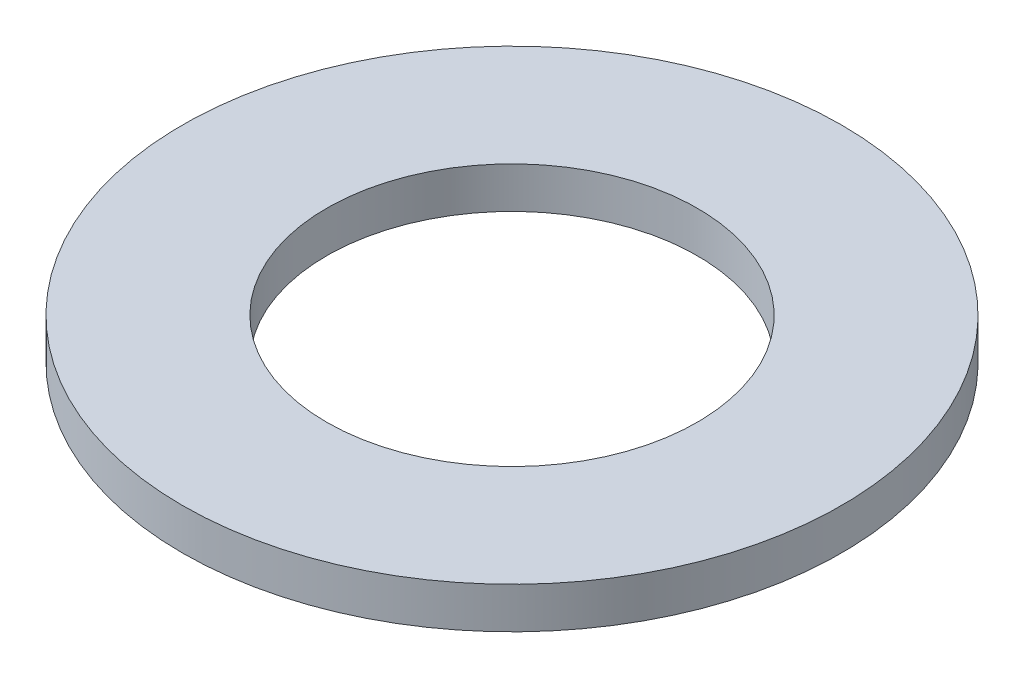
ISO-10303-21;
HEADER;
FILE_DESCRIPTION(('STEP AP214'),'2;1');
FILE_NAME('part.step','',(''),(''),'','','');
FILE_SCHEMA(('AUTOMOTIVE_DESIGN { 1 0 10303 214 1 1 1 1 }'));
ENDSEC;
DATA;
#1=APPLICATION_CONTEXT('core data for automotive mechanical design processes');
#2=APPLICATION_PROTOCOL_DEFINITION('international standard','automotive_design',2000,#1);
#3=PRODUCT_CONTEXT('',#1,'mechanical');
#4=PRODUCT('Part','Part','',(#3));
#5=PRODUCT_RELATED_PRODUCT_CATEGORY('part','',(#4));
#6=PRODUCT_DEFINITION_FORMATION('','',#4);
#7=PRODUCT_DEFINITION_CONTEXT('part definition',#1,'design');
#8=PRODUCT_DEFINITION('design','',#6,#7);
#9=PRODUCT_DEFINITION_SHAPE('','',#8);
#10=(LENGTH_UNIT() NAMED_UNIT(*) SI_UNIT(.MILLI.,.METRE.));
#11=(NAMED_UNIT(*) PLANE_ANGLE_UNIT() SI_UNIT($,.RADIAN.));
#12=(NAMED_UNIT(*) SI_UNIT($,.STERADIAN.) SOLID_ANGLE_UNIT());
#13=UNCERTAINTY_MEASURE_WITH_UNIT(LENGTH_MEASURE(1.E-05),#10,'distance_accuracy_value','');
#14=(GEOMETRIC_REPRESENTATION_CONTEXT(3) GLOBAL_UNCERTAINTY_ASSIGNED_CONTEXT((#13)) GLOBAL_UNIT_ASSIGNED_CONTEXT((#10,
#11,#12)) REPRESENTATION_CONTEXT('',''));
#15=CARTESIAN_POINT('',(0.,0.,0.));
#16=DIRECTION('',(0.,0.,1.));
#17=DIRECTION('',(1.,0.,0.));
#18=AXIS2_PLACEMENT_3D('',#15,#16,#17);
#19=CARTESIAN_POINT('',(0.,1.,0.));
#20=DIRECTION('',(0.,1.,0.));
#21=DIRECTION('',(0.,0.,1.));
#22=AXIS2_PLACEMENT_3D('',#19,#20,#21);
#23=PLANE('',#22);
#24=CARTESIAN_POINT('',(0.,1.,0.));
#25=DIRECTION('',(0.,1.,0.));
#26=DIRECTION('',(0.,0.,1.));
#27=AXIS2_PLACEMENT_3D('',#24,#25,#26);
#28=CIRCLE('',#27,8.);
#29=CARTESIAN_POINT('',(0.,1.,8.));
#30=VERTEX_POINT('',#29);
#31=EDGE_CURVE('E10',#30,#30,#28,.T.);
#32=ORIENTED_EDGE('',*,*,#31,.T.);
#33=EDGE_LOOP('',(#32));
#34=FACE_BOUND('',#33,.T.);
#35=CARTESIAN_POINT('',(0.,1.,0.));
#36=DIRECTION('',(0.,1.,0.));
#37=DIRECTION('',(0.,0.,1.));
#38=AXIS2_PLACEMENT_3D('',#35,#36,#37);
#39=CIRCLE('',#38,4.5);
#40=CARTESIAN_POINT('',(0.,1.,4.5));
#41=VERTEX_POINT('',#40);
#42=EDGE_CURVE('E45',#41,#41,#39,.T.);
#43=ORIENTED_EDGE('',*,*,#42,.F.);
#44=EDGE_LOOP('',(#43));
#45=FACE_BOUND('',#44,.T.);
#46=ADVANCED_FACE('F34',(#34,#45),#23,.T.);
#47=CARTESIAN_POINT('',(0.,0.,0.));
#48=DIRECTION('',(0.,1.,0.));
#49=DIRECTION('',(0.,0.,1.));
#50=AXIS2_PLACEMENT_3D('',#47,#48,#49);
#51=PLANE('',#50);
#52=CARTESIAN_POINT('',(0.,0.,0.));
#53=DIRECTION('',(0.,1.,0.));
#54=DIRECTION('',(0.,0.,1.));
#55=AXIS2_PLACEMENT_3D('',#52,#53,#54);
#56=CIRCLE('',#55,8.);
#57=CARTESIAN_POINT('',(0.,0.,8.));
#58=VERTEX_POINT('',#57);
#59=EDGE_CURVE('E38',#58,#58,#56,.T.);
#60=ORIENTED_EDGE('',*,*,#59,.F.);
#61=EDGE_LOOP('',(#60));
#62=FACE_BOUND('',#61,.T.);
#63=CARTESIAN_POINT('',(0.,0.,0.));
#64=DIRECTION('',(0.,1.,0.));
#65=DIRECTION('',(0.,0.,1.));
#66=AXIS2_PLACEMENT_3D('',#63,#64,#65);
#67=CIRCLE('',#66,4.5);
#68=CARTESIAN_POINT('',(0.,0.,4.5));
#69=VERTEX_POINT('',#68);
#70=EDGE_CURVE('E47',#69,#69,#67,.T.);
#71=ORIENTED_EDGE('',*,*,#70,.T.);
#72=EDGE_LOOP('',(#71));
#73=FACE_BOUND('',#72,.T.);
#74=ADVANCED_FACE('F57',(#62,#73),#51,.F.);
#75=CARTESIAN_POINT('',(0.,1.,0.));
#76=DIRECTION('',(0.,-1.,0.));
#77=DIRECTION('',(0.,0.,-1.));
#78=AXIS2_PLACEMENT_3D('',#75,#76,#77);
#79=CYLINDRICAL_SURFACE('',#78,8.);
#80=ORIENTED_EDGE('',*,*,#31,.F.);
#81=EDGE_LOOP('',(#80));
#82=FACE_BOUND('',#81,.T.);
#83=ORIENTED_EDGE('',*,*,#59,.T.);
#84=EDGE_LOOP('',(#83));
#85=FACE_BOUND('',#84,.T.);
#86=ADVANCED_FACE('F36',(#82,#85),#79,.T.);
#87=CARTESIAN_POINT('',(0.,1.,0.));
#88=DIRECTION('',(0.,-1.,0.));
#89=DIRECTION('',(0.,0.,-1.));
#90=AXIS2_PLACEMENT_3D('',#87,#88,#89);
#91=CYLINDRICAL_SURFACE('',#90,4.5);
#92=ORIENTED_EDGE('',*,*,#42,.T.);
#93=EDGE_LOOP('',(#92));
#94=FACE_BOUND('',#93,.T.);
#95=ORIENTED_EDGE('',*,*,#70,.F.);
#96=EDGE_LOOP('',(#95));
#97=FACE_BOUND('',#96,.T.);
#98=ADVANCED_FACE('F53',(#94,#97),#91,.F.);
#99=CLOSED_SHELL('',(#46,#74,#86,#98));
#100=MANIFOLD_SOLID_BREP('B2',#99);
#101=ADVANCED_BREP_SHAPE_REPRESENTATION('',(#18,#100),#14);
#102=SHAPE_DEFINITION_REPRESENTATION(#9,#101);
ENDSEC;
END-ISO-10303-21;
